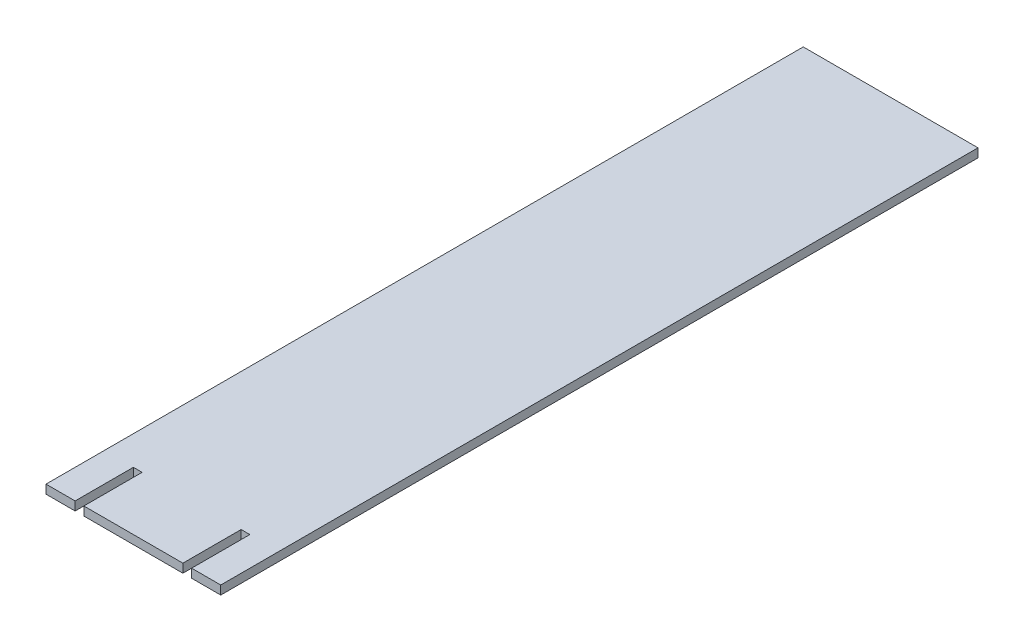
ISO-10303-21;
HEADER;
FILE_DESCRIPTION(('STEP AP214'),'2;1');
FILE_NAME('part.step','',(''),(''),'','','');
FILE_SCHEMA(('AUTOMOTIVE_DESIGN { 1 0 10303 214 1 1 1 1 }'));
ENDSEC;
DATA;
#1=APPLICATION_CONTEXT('core data for automotive mechanical design processes');
#2=APPLICATION_PROTOCOL_DEFINITION('international standard','automotive_design',2000,#1);
#3=PRODUCT_CONTEXT('',#1,'mechanical');
#4=PRODUCT('Part','Part','',(#3));
#5=PRODUCT_RELATED_PRODUCT_CATEGORY('part','',(#4));
#6=PRODUCT_DEFINITION_FORMATION('','',#4);
#7=PRODUCT_DEFINITION_CONTEXT('part definition',#1,'design');
#8=PRODUCT_DEFINITION('design','',#6,#7);
#9=PRODUCT_DEFINITION_SHAPE('','',#8);
#10=(LENGTH_UNIT() NAMED_UNIT(*) SI_UNIT(.MILLI.,.METRE.));
#11=(NAMED_UNIT(*) PLANE_ANGLE_UNIT() SI_UNIT($,.RADIAN.));
#12=(NAMED_UNIT(*) SI_UNIT($,.STERADIAN.) SOLID_ANGLE_UNIT());
#13=UNCERTAINTY_MEASURE_WITH_UNIT(LENGTH_MEASURE(1.E-05),#10,'distance_accuracy_value','');
#14=(GEOMETRIC_REPRESENTATION_CONTEXT(3) GLOBAL_UNCERTAINTY_ASSIGNED_CONTEXT((#13)) GLOBAL_UNIT_ASSIGNED_CONTEXT((#10,
#11,#12)) REPRESENTATION_CONTEXT('',''));
#15=CARTESIAN_POINT('',(0.,0.,0.));
#16=DIRECTION('',(0.,0.,1.));
#17=DIRECTION('',(1.,0.,0.));
#18=AXIS2_PLACEMENT_3D('',#15,#16,#17);
#19=CARTESIAN_POINT('',(0.,3.,0.));
#20=DIRECTION('',(1.,0.,0.));
#21=DIRECTION('',(0.,0.,-1.));
#22=AXIS2_PLACEMENT_3D('',#19,#20,#21);
#23=PLANE('',#22);
#24=DIRECTION('',(0.,0.,1.));
#25=VECTOR('',#24,1.);
#26=CARTESIAN_POINT('',(0.,0.,0.));
#27=LINE('',#26,#25);
#28=CARTESIAN_POINT('',(0.,0.,-260.));
#29=VERTEX_POINT('',#28);
#30=CARTESIAN_POINT('',(0.,0.,0.));
#31=VERTEX_POINT('',#30);
#32=EDGE_CURVE('E164',#29,#31,#27,.T.);
#33=ORIENTED_EDGE('',*,*,#32,.T.);
#34=DIRECTION('',(0.,-1.,0.));
#35=VECTOR('',#34,1.);
#36=CARTESIAN_POINT('',(0.,3.,0.));
#37=LINE('',#36,#35);
#38=CARTESIAN_POINT('',(0.,3.,0.));
#39=VERTEX_POINT('',#38);
#40=EDGE_CURVE('E11',#39,#31,#37,.T.);
#41=ORIENTED_EDGE('',*,*,#40,.F.);
#42=DIRECTION('',(0.,0.,1.));
#43=VECTOR('',#42,1.);
#44=CARTESIAN_POINT('',(0.,3.,0.));
#45=LINE('',#44,#43);
#46=CARTESIAN_POINT('',(0.,3.,-260.));
#47=VERTEX_POINT('',#46);
#48=EDGE_CURVE('E198',#47,#39,#45,.T.);
#49=ORIENTED_EDGE('',*,*,#48,.F.);
#50=DIRECTION('',(0.,-1.,0.));
#51=VECTOR('',#50,1.);
#52=CARTESIAN_POINT('',(0.,3.,-260.));
#53=LINE('',#52,#51);
#54=EDGE_CURVE('E160',#47,#29,#53,.T.);
#55=ORIENTED_EDGE('',*,*,#54,.T.);
#56=EDGE_LOOP('',(#33,#41,#49,#55));
#57=FACE_BOUND('',#56,.T.);
#58=ADVANCED_FACE('F39',(#57),#23,.F.);
#59=CARTESIAN_POINT('',(0.,3.,0.));
#60=DIRECTION('',(0.,0.,-1.));
#61=DIRECTION('',(-1.,0.,0.));
#62=AXIS2_PLACEMENT_3D('',#59,#60,#61);
#63=PLANE('',#62);
#64=DIRECTION('',(1.,0.,0.));
#65=VECTOR('',#64,1.);
#66=CARTESIAN_POINT('',(0.,0.,0.));
#67=LINE('',#66,#65);
#68=CARTESIAN_POINT('',(10.,0.,0.));
#69=VERTEX_POINT('',#68);
#70=EDGE_CURVE('E168',#31,#69,#67,.T.);
#71=ORIENTED_EDGE('',*,*,#70,.T.);
#72=DIRECTION('',(0.,-1.,0.));
#73=VECTOR('',#72,1.);
#74=CARTESIAN_POINT('',(10.,3.,0.));
#75=LINE('',#74,#73);
#76=CARTESIAN_POINT('',(10.,3.,0.));
#77=VERTEX_POINT('',#76);
#78=EDGE_CURVE('E48',#77,#69,#75,.T.);
#79=ORIENTED_EDGE('',*,*,#78,.F.);
#80=DIRECTION('',(1.,0.,0.));
#81=VECTOR('',#80,1.);
#82=CARTESIAN_POINT('',(0.,3.,0.));
#83=LINE('',#82,#81);
#84=EDGE_CURVE('E111',#39,#77,#83,.T.);
#85=ORIENTED_EDGE('',*,*,#84,.F.);
#86=ORIENTED_EDGE('',*,*,#40,.T.);
#87=EDGE_LOOP('',(#71,#79,#85,#86));
#88=FACE_BOUND('',#87,.T.);
#89=ADVANCED_FACE('F292',(#88),#63,.F.);
#90=CARTESIAN_POINT('',(10.,3.,0.));
#91=DIRECTION('',(-1.,0.,0.));
#92=DIRECTION('',(0.,0.,1.));
#93=AXIS2_PLACEMENT_3D('',#90,#91,#92);
#94=PLANE('',#93);
#95=DIRECTION('',(0.,0.,-1.));
#96=VECTOR('',#95,1.);
#97=CARTESIAN_POINT('',(10.,0.,0.));
#98=LINE('',#97,#96);
#99=CARTESIAN_POINT('',(10.,0.,-20.));
#100=VERTEX_POINT('',#99);
#101=EDGE_CURVE('E171',#69,#100,#98,.T.);
#102=ORIENTED_EDGE('',*,*,#101,.T.);
#103=DIRECTION('',(0.,-1.,0.));
#104=VECTOR('',#103,1.);
#105=CARTESIAN_POINT('',(10.,3.,-20.));
#106=LINE('',#105,#104);
#107=CARTESIAN_POINT('',(10.,3.,-20.));
#108=VERTEX_POINT('',#107);
#109=EDGE_CURVE('E225',#108,#100,#106,.T.);
#110=ORIENTED_EDGE('',*,*,#109,.F.);
#111=DIRECTION('',(0.,0.,-1.));
#112=VECTOR('',#111,1.);
#113=CARTESIAN_POINT('',(10.,3.,0.));
#114=LINE('',#113,#112);
#115=EDGE_CURVE('E235',#77,#108,#114,.T.);
#116=ORIENTED_EDGE('',*,*,#115,.F.);
#117=ORIENTED_EDGE('',*,*,#78,.T.);
#118=EDGE_LOOP('',(#102,#110,#116,#117));
#119=FACE_BOUND('',#118,.T.);
#120=ADVANCED_FACE('F233',(#119),#94,.F.);
#121=CARTESIAN_POINT('',(10.,3.,-20.));
#122=DIRECTION('',(0.,0.,-1.));
#123=DIRECTION('',(-1.,0.,0.));
#124=AXIS2_PLACEMENT_3D('',#121,#122,#123);
#125=PLANE('',#124);
#126=DIRECTION('',(1.,0.,0.));
#127=VECTOR('',#126,1.);
#128=CARTESIAN_POINT('',(10.,0.,-20.));
#129=LINE('',#128,#127);
#130=CARTESIAN_POINT('',(13.,0.,-20.));
#131=VERTEX_POINT('',#130);
#132=EDGE_CURVE('E174',#100,#131,#129,.T.);
#133=ORIENTED_EDGE('',*,*,#132,.T.);
#134=DIRECTION('',(0.,-1.,0.));
#135=VECTOR('',#134,1.);
#136=CARTESIAN_POINT('',(13.,3.,-20.));
#137=LINE('',#136,#135);
#138=CARTESIAN_POINT('',(13.,3.,-20.));
#139=VERTEX_POINT('',#138);
#140=EDGE_CURVE('E221',#139,#131,#137,.T.);
#141=ORIENTED_EDGE('',*,*,#140,.F.);
#142=DIRECTION('',(1.,0.,0.));
#143=VECTOR('',#142,1.);
#144=CARTESIAN_POINT('',(10.,3.,-20.));
#145=LINE('',#144,#143);
#146=EDGE_CURVE('E254',#108,#139,#145,.T.);
#147=ORIENTED_EDGE('',*,*,#146,.F.);
#148=ORIENTED_EDGE('',*,*,#109,.T.);
#149=EDGE_LOOP('',(#133,#141,#147,#148));
#150=FACE_BOUND('',#149,.T.);
#151=ADVANCED_FACE('F244',(#150),#125,.F.);
#152=CARTESIAN_POINT('',(13.,3.,0.));
#153=DIRECTION('',(1.,0.,0.));
#154=DIRECTION('',(0.,0.,-1.));
#155=AXIS2_PLACEMENT_3D('',#152,#153,#154);
#156=PLANE('',#155);
#157=DIRECTION('',(0.,0.,1.));
#158=VECTOR('',#157,1.);
#159=CARTESIAN_POINT('',(13.,0.,0.));
#160=LINE('',#159,#158);
#161=CARTESIAN_POINT('',(13.,0.,0.));
#162=VERTEX_POINT('',#161);
#163=EDGE_CURVE('E177',#131,#162,#160,.T.);
#164=ORIENTED_EDGE('',*,*,#163,.T.);
#165=DIRECTION('',(0.,-1.,0.));
#166=VECTOR('',#165,1.);
#167=CARTESIAN_POINT('',(13.,3.,0.));
#168=LINE('',#167,#166);
#169=CARTESIAN_POINT('',(13.,3.,0.));
#170=VERTEX_POINT('',#169);
#171=EDGE_CURVE('E217',#170,#162,#168,.T.);
#172=ORIENTED_EDGE('',*,*,#171,.F.);
#173=DIRECTION('',(0.,0.,1.));
#174=VECTOR('',#173,1.);
#175=CARTESIAN_POINT('',(13.,3.,0.));
#176=LINE('',#175,#174);
#177=EDGE_CURVE('E250',#139,#170,#176,.T.);
#178=ORIENTED_EDGE('',*,*,#177,.F.);
#179=ORIENTED_EDGE('',*,*,#140,.T.);
#180=EDGE_LOOP('',(#164,#172,#178,#179));
#181=FACE_BOUND('',#180,.T.);
#182=ADVANCED_FACE('F248',(#181),#156,.F.);
#183=CARTESIAN_POINT('',(13.,3.,0.));
#184=DIRECTION('',(0.,0.,-1.));
#185=DIRECTION('',(-1.,0.,0.));
#186=AXIS2_PLACEMENT_3D('',#183,#184,#185);
#187=PLANE('',#186);
#188=DIRECTION('',(1.,0.,0.));
#189=VECTOR('',#188,1.);
#190=CARTESIAN_POINT('',(13.,0.,0.));
#191=LINE('',#190,#189);
#192=CARTESIAN_POINT('',(47.,0.,0.));
#193=VERTEX_POINT('',#192);
#194=EDGE_CURVE('E180',#162,#193,#191,.T.);
#195=ORIENTED_EDGE('',*,*,#194,.T.);
#196=DIRECTION('',(0.,-1.,0.));
#197=VECTOR('',#196,1.);
#198=CARTESIAN_POINT('',(47.,3.,0.));
#199=LINE('',#198,#197);
#200=CARTESIAN_POINT('',(47.,3.,0.));
#201=VERTEX_POINT('',#200);
#202=EDGE_CURVE('E213',#201,#193,#199,.T.);
#203=ORIENTED_EDGE('',*,*,#202,.F.);
#204=DIRECTION('',(1.,0.,0.));
#205=VECTOR('',#204,1.);
#206=CARTESIAN_POINT('',(13.,3.,0.));
#207=LINE('',#206,#205);
#208=EDGE_CURVE('E253',#170,#201,#207,.T.);
#209=ORIENTED_EDGE('',*,*,#208,.F.);
#210=ORIENTED_EDGE('',*,*,#171,.T.);
#211=EDGE_LOOP('',(#195,#203,#209,#210));
#212=FACE_BOUND('',#211,.T.);
#213=ADVANCED_FACE('F305',(#212),#187,.F.);
#214=CARTESIAN_POINT('',(47.,3.,0.));
#215=DIRECTION('',(-1.,0.,0.));
#216=DIRECTION('',(0.,0.,1.));
#217=AXIS2_PLACEMENT_3D('',#214,#215,#216);
#218=PLANE('',#217);
#219=DIRECTION('',(0.,0.,-1.));
#220=VECTOR('',#219,1.);
#221=CARTESIAN_POINT('',(47.,0.,0.));
#222=LINE('',#221,#220);
#223=CARTESIAN_POINT('',(47.,0.,-20.));
#224=VERTEX_POINT('',#223);
#225=EDGE_CURVE('E183',#193,#224,#222,.T.);
#226=ORIENTED_EDGE('',*,*,#225,.T.);
#227=DIRECTION('',(0.,-1.,0.));
#228=VECTOR('',#227,1.);
#229=CARTESIAN_POINT('',(47.,3.,-20.));
#230=LINE('',#229,#228);
#231=CARTESIAN_POINT('',(47.,3.,-20.));
#232=VERTEX_POINT('',#231);
#233=EDGE_CURVE('E209',#232,#224,#230,.T.);
#234=ORIENTED_EDGE('',*,*,#233,.F.);
#235=DIRECTION('',(0.,0.,-1.));
#236=VECTOR('',#235,1.);
#237=CARTESIAN_POINT('',(47.,3.,0.));
#238=LINE('',#237,#236);
#239=EDGE_CURVE('E258',#201,#232,#238,.T.);
#240=ORIENTED_EDGE('',*,*,#239,.F.);
#241=ORIENTED_EDGE('',*,*,#202,.T.);
#242=EDGE_LOOP('',(#226,#234,#240,#241));
#243=FACE_BOUND('',#242,.T.);
#244=ADVANCED_FACE('F308',(#243),#218,.F.);
#245=CARTESIAN_POINT('',(47.,3.,-20.));
#246=DIRECTION('',(0.,0.,-1.));
#247=DIRECTION('',(-1.,0.,0.));
#248=AXIS2_PLACEMENT_3D('',#245,#246,#247);
#249=PLANE('',#248);
#250=DIRECTION('',(1.,0.,0.));
#251=VECTOR('',#250,1.);
#252=CARTESIAN_POINT('',(47.,0.,-20.));
#253=LINE('',#252,#251);
#254=CARTESIAN_POINT('',(50.,0.,-20.));
#255=VERTEX_POINT('',#254);
#256=EDGE_CURVE('E186',#224,#255,#253,.T.);
#257=ORIENTED_EDGE('',*,*,#256,.T.);
#258=DIRECTION('',(0.,-1.,0.));
#259=VECTOR('',#258,1.);
#260=CARTESIAN_POINT('',(50.,3.,-20.));
#261=LINE('',#260,#259);
#262=CARTESIAN_POINT('',(50.,3.,-20.));
#263=VERTEX_POINT('',#262);
#264=EDGE_CURVE('E205',#263,#255,#261,.T.);
#265=ORIENTED_EDGE('',*,*,#264,.F.);
#266=DIRECTION('',(1.,0.,0.));
#267=VECTOR('',#266,1.);
#268=CARTESIAN_POINT('',(47.,3.,-20.));
#269=LINE('',#268,#267);
#270=EDGE_CURVE('E265',#232,#263,#269,.T.);
#271=ORIENTED_EDGE('',*,*,#270,.F.);
#272=ORIENTED_EDGE('',*,*,#233,.T.);
#273=EDGE_LOOP('',(#257,#265,#271,#272));
#274=FACE_BOUND('',#273,.T.);
#275=ADVANCED_FACE('F273',(#274),#249,.F.);
#276=CARTESIAN_POINT('',(50.,3.,0.));
#277=DIRECTION('',(1.,0.,0.));
#278=DIRECTION('',(0.,0.,-1.));
#279=AXIS2_PLACEMENT_3D('',#276,#277,#278);
#280=PLANE('',#279);
#281=DIRECTION('',(0.,0.,1.));
#282=VECTOR('',#281,1.);
#283=CARTESIAN_POINT('',(50.,0.,0.));
#284=LINE('',#283,#282);
#285=CARTESIAN_POINT('',(50.,0.,0.));
#286=VERTEX_POINT('',#285);
#287=EDGE_CURVE('E189',#255,#286,#284,.T.);
#288=ORIENTED_EDGE('',*,*,#287,.T.);
#289=DIRECTION('',(0.,-1.,0.));
#290=VECTOR('',#289,1.);
#291=CARTESIAN_POINT('',(50.,3.,0.));
#292=LINE('',#291,#290);
#293=CARTESIAN_POINT('',(50.,3.,0.));
#294=VERTEX_POINT('',#293);
#295=EDGE_CURVE('E153',#294,#286,#292,.T.);
#296=ORIENTED_EDGE('',*,*,#295,.F.);
#297=DIRECTION('',(0.,0.,1.));
#298=VECTOR('',#297,1.);
#299=CARTESIAN_POINT('',(50.,3.,0.));
#300=LINE('',#299,#298);
#301=EDGE_CURVE('E142',#263,#294,#300,.T.);
#302=ORIENTED_EDGE('',*,*,#301,.F.);
#303=ORIENTED_EDGE('',*,*,#264,.T.);
#304=EDGE_LOOP('',(#288,#296,#302,#303));
#305=FACE_BOUND('',#304,.T.);
#306=ADVANCED_FACE('F277',(#305),#280,.F.);
#307=CARTESIAN_POINT('',(50.,3.,0.));
#308=DIRECTION('',(0.,0.,-1.));
#309=DIRECTION('',(-1.,0.,0.));
#310=AXIS2_PLACEMENT_3D('',#307,#308,#309);
#311=PLANE('',#310);
#312=DIRECTION('',(1.,0.,0.));
#313=VECTOR('',#312,1.);
#314=CARTESIAN_POINT('',(50.,0.,0.));
#315=LINE('',#314,#313);
#316=CARTESIAN_POINT('',(60.,0.,0.));
#317=VERTEX_POINT('',#316);
#318=EDGE_CURVE('E151',#286,#317,#315,.T.);
#319=ORIENTED_EDGE('',*,*,#318,.T.);
#320=DIRECTION('',(0.,-1.,0.));
#321=VECTOR('',#320,1.);
#322=CARTESIAN_POINT('',(60.,3.,0.));
#323=LINE('',#322,#321);
#324=CARTESIAN_POINT('',(60.,3.,0.));
#325=VERTEX_POINT('',#324);
#326=EDGE_CURVE('E148',#325,#317,#323,.T.);
#327=ORIENTED_EDGE('',*,*,#326,.F.);
#328=DIRECTION('',(1.,0.,0.));
#329=VECTOR('',#328,1.);
#330=CARTESIAN_POINT('',(50.,3.,0.));
#331=LINE('',#330,#329);
#332=EDGE_CURVE('E136',#294,#325,#331,.T.);
#333=ORIENTED_EDGE('',*,*,#332,.F.);
#334=ORIENTED_EDGE('',*,*,#295,.T.);
#335=EDGE_LOOP('',(#319,#327,#333,#334));
#336=FACE_BOUND('',#335,.T.);
#337=ADVANCED_FACE('F149',(#336),#311,.F.);
#338=CARTESIAN_POINT('',(60.,3.,0.));
#339=DIRECTION('',(-1.,0.,0.));
#340=DIRECTION('',(0.,0.,1.));
#341=AXIS2_PLACEMENT_3D('',#338,#339,#340);
#342=PLANE('',#341);
#343=DIRECTION('',(0.,0.,-1.));
#344=VECTOR('',#343,1.);
#345=CARTESIAN_POINT('',(60.,0.,0.));
#346=LINE('',#345,#344);
#347=CARTESIAN_POINT('',(60.,0.,-260.));
#348=VERTEX_POINT('',#347);
#349=EDGE_CURVE('E97',#317,#348,#346,.T.);
#350=ORIENTED_EDGE('',*,*,#349,.T.);
#351=DIRECTION('',(0.,-1.,0.));
#352=VECTOR('',#351,1.);
#353=CARTESIAN_POINT('',(60.,3.,-260.));
#354=LINE('',#353,#352);
#355=CARTESIAN_POINT('',(60.,3.,-260.));
#356=VERTEX_POINT('',#355);
#357=EDGE_CURVE('E154',#356,#348,#354,.T.);
#358=ORIENTED_EDGE('',*,*,#357,.F.);
#359=DIRECTION('',(0.,0.,-1.));
#360=VECTOR('',#359,1.);
#361=CARTESIAN_POINT('',(60.,3.,0.));
#362=LINE('',#361,#360);
#363=EDGE_CURVE('E140',#325,#356,#362,.T.);
#364=ORIENTED_EDGE('',*,*,#363,.F.);
#365=ORIENTED_EDGE('',*,*,#326,.T.);
#366=EDGE_LOOP('',(#350,#358,#364,#365));
#367=FACE_BOUND('',#366,.T.);
#368=ADVANCED_FACE('F156',(#367),#342,.F.);
#369=CARTESIAN_POINT('',(0.,3.,-260.));
#370=DIRECTION('',(0.,0.,1.));
#371=DIRECTION('',(1.,0.,0.));
#372=AXIS2_PLACEMENT_3D('',#369,#370,#371);
#373=PLANE('',#372);
#374=DIRECTION('',(-1.,0.,0.));
#375=VECTOR('',#374,1.);
#376=CARTESIAN_POINT('',(0.,0.,-260.));
#377=LINE('',#376,#375);
#378=EDGE_CURVE('E103',#348,#29,#377,.T.);
#379=ORIENTED_EDGE('',*,*,#378,.T.);
#380=ORIENTED_EDGE('',*,*,#54,.F.);
#381=DIRECTION('',(-1.,0.,0.));
#382=VECTOR('',#381,1.);
#383=CARTESIAN_POINT('',(0.,3.,-260.));
#384=LINE('',#383,#382);
#385=EDGE_CURVE('E56',#356,#47,#384,.T.);
#386=ORIENTED_EDGE('',*,*,#385,.F.);
#387=ORIENTED_EDGE('',*,*,#357,.T.);
#388=EDGE_LOOP('',(#379,#380,#386,#387));
#389=FACE_BOUND('',#388,.T.);
#390=ADVANCED_FACE('F281',(#389),#373,.F.);
#391=CARTESIAN_POINT('',(0.,3.,0.));
#392=DIRECTION('',(0.,-1.,0.));
#393=DIRECTION('',(0.,0.,-1.));
#394=AXIS2_PLACEMENT_3D('',#391,#392,#393);
#395=PLANE('',#394);
#396=ORIENTED_EDGE('',*,*,#48,.T.);
#397=ORIENTED_EDGE('',*,*,#84,.T.);
#398=ORIENTED_EDGE('',*,*,#115,.T.);
#399=ORIENTED_EDGE('',*,*,#146,.T.);
#400=ORIENTED_EDGE('',*,*,#177,.T.);
#401=ORIENTED_EDGE('',*,*,#208,.T.);
#402=ORIENTED_EDGE('',*,*,#239,.T.);
#403=ORIENTED_EDGE('',*,*,#270,.T.);
#404=ORIENTED_EDGE('',*,*,#301,.T.);
#405=ORIENTED_EDGE('',*,*,#332,.T.);
#406=ORIENTED_EDGE('',*,*,#363,.T.);
#407=ORIENTED_EDGE('',*,*,#385,.T.);
#408=EDGE_LOOP('',(#396,#397,#398,#399,#400,#401,#402,#403,#404,#405,#406,#407));
#409=FACE_BOUND('',#408,.T.);
#410=ADVANCED_FACE('F138',(#409),#395,.F.);
#411=CARTESIAN_POINT('',(0.,0.,0.));
#412=DIRECTION('',(0.,-1.,0.));
#413=DIRECTION('',(0.,0.,-1.));
#414=AXIS2_PLACEMENT_3D('',#411,#412,#413);
#415=PLANE('',#414);
#416=ORIENTED_EDGE('',*,*,#32,.F.);
#417=ORIENTED_EDGE('',*,*,#378,.F.);
#418=ORIENTED_EDGE('',*,*,#349,.F.);
#419=ORIENTED_EDGE('',*,*,#318,.F.);
#420=ORIENTED_EDGE('',*,*,#287,.F.);
#421=ORIENTED_EDGE('',*,*,#256,.F.);
#422=ORIENTED_EDGE('',*,*,#225,.F.);
#423=ORIENTED_EDGE('',*,*,#194,.F.);
#424=ORIENTED_EDGE('',*,*,#163,.F.);
#425=ORIENTED_EDGE('',*,*,#132,.F.);
#426=ORIENTED_EDGE('',*,*,#101,.F.);
#427=ORIENTED_EDGE('',*,*,#70,.F.);
#428=EDGE_LOOP('',(#416,#417,#418,#419,#420,#421,#422,#423,#424,#425,#426,#427));
#429=FACE_BOUND('',#428,.T.);
#430=ADVANCED_FACE('F239',(#429),#415,.T.);
#431=CLOSED_SHELL('',(#58,#89,#120,#151,#182,#213,#244,#275,#306,#337,#368,#390,#410,#430));
#432=MANIFOLD_SOLID_BREP('B2',#431);
#433=ADVANCED_BREP_SHAPE_REPRESENTATION('',(#18,#432),#14);
#434=SHAPE_DEFINITION_REPRESENTATION(#9,#433);
ENDSEC;
END-ISO-10303-21;
